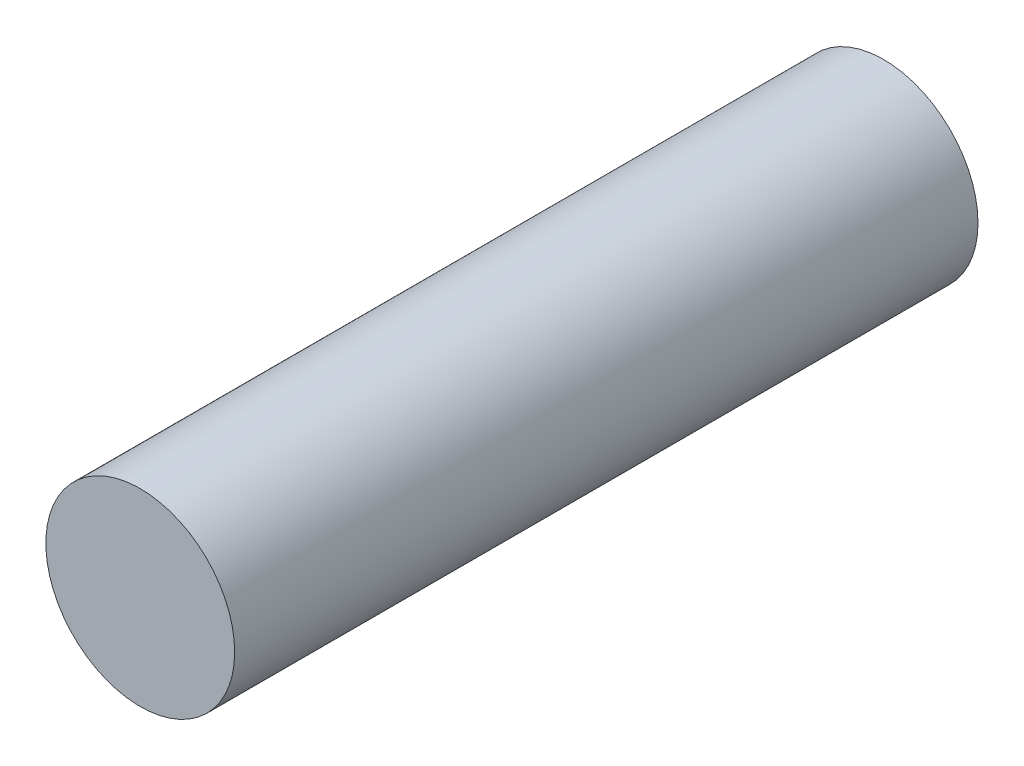
ISO-10303-21;
HEADER;
FILE_DESCRIPTION(('STEP AP214'),'2;1');
FILE_NAME('part.step','',(''),(''),'','','');
FILE_SCHEMA(('AUTOMOTIVE_DESIGN { 1 0 10303 214 1 1 1 1 }'));
ENDSEC;
DATA;
#1=APPLICATION_CONTEXT('core data for automotive mechanical design processes');
#2=APPLICATION_PROTOCOL_DEFINITION('international standard','automotive_design',2000,#1);
#3=PRODUCT_CONTEXT('',#1,'mechanical');
#4=PRODUCT('Part','Part','',(#3));
#5=PRODUCT_RELATED_PRODUCT_CATEGORY('part','',(#4));
#6=PRODUCT_DEFINITION_FORMATION('','',#4);
#7=PRODUCT_DEFINITION_CONTEXT('part definition',#1,'design');
#8=PRODUCT_DEFINITION('design','',#6,#7);
#9=PRODUCT_DEFINITION_SHAPE('','',#8);
#10=(LENGTH_UNIT() NAMED_UNIT(*) SI_UNIT(.MILLI.,.METRE.));
#11=(NAMED_UNIT(*) PLANE_ANGLE_UNIT() SI_UNIT($,.RADIAN.));
#12=(NAMED_UNIT(*) SI_UNIT($,.STERADIAN.) SOLID_ANGLE_UNIT());
#13=UNCERTAINTY_MEASURE_WITH_UNIT(LENGTH_MEASURE(1.E-05),#10,'distance_accuracy_value','');
#14=(GEOMETRIC_REPRESENTATION_CONTEXT(3) GLOBAL_UNCERTAINTY_ASSIGNED_CONTEXT((#13)) GLOBAL_UNIT_ASSIGNED_CONTEXT((#10,
#11,#12)) REPRESENTATION_CONTEXT('',''));
#15=CARTESIAN_POINT('',(0.,0.,0.));
#16=DIRECTION('',(0.,0.,1.));
#17=DIRECTION('',(1.,0.,0.));
#18=AXIS2_PLACEMENT_3D('',#15,#16,#17);
#19=CARTESIAN_POINT('',(0.,0.,1.00000000000006));
#20=DIRECTION('',(0.,0.,1.));
#21=DIRECTION('',(1.,0.,0.));
#22=AXIS2_PLACEMENT_3D('',#19,#20,#21);
#23=PLANE('',#22);
#24=CARTESIAN_POINT('',(0.,0.,1.00000000000006));
#25=DIRECTION('',(0.,0.,1.));
#26=DIRECTION('',(1.,0.,0.));
#27=AXIS2_PLACEMENT_3D('',#24,#25,#26);
#28=CIRCLE('',#27,0.127);
#29=CARTESIAN_POINT('',(0.127,0.,1.00000000000006));
#30=VERTEX_POINT('',#29);
#31=EDGE_CURVE('E18',#30,#30,#28,.F.);
#32=ORIENTED_EDGE('',*,*,#31,.F.);
#33=EDGE_LOOP('',(#32));
#34=FACE_BOUND('',#33,.T.);
#35=ADVANCED_FACE('F15',(#34),#23,.T.);
#36=CARTESIAN_POINT('',(0.,0.,0.));
#37=DIRECTION('',(0.,0.,1.));
#38=DIRECTION('',(1.,0.,0.));
#39=AXIS2_PLACEMENT_3D('',#36,#37,#38);
#40=PLANE('',#39);
#41=CARTESIAN_POINT('',(0.,0.,0.));
#42=DIRECTION('',(0.,0.,1.));
#43=DIRECTION('',(1.,0.,0.));
#44=AXIS2_PLACEMENT_3D('',#41,#42,#43);
#45=CIRCLE('',#44,0.127);
#46=CARTESIAN_POINT('',(0.127,0.,0.));
#47=VERTEX_POINT('',#46);
#48=EDGE_CURVE('E10',#47,#47,#45,.T.);
#49=ORIENTED_EDGE('',*,*,#48,.F.);
#50=EDGE_LOOP('',(#49));
#51=FACE_BOUND('',#50,.T.);
#52=ADVANCED_FACE('F30',(#51),#40,.F.);
#53=CARTESIAN_POINT('',(0.,0.,0.));
#54=DIRECTION('',(0.,0.,1.));
#55=DIRECTION('',(1.,0.,0.));
#56=AXIS2_PLACEMENT_3D('',#53,#54,#55);
#57=CYLINDRICAL_SURFACE('',#56,0.127);
#58=ORIENTED_EDGE('',*,*,#31,.T.);
#59=EDGE_LOOP('',(#58));
#60=FACE_BOUND('',#59,.T.);
#61=ORIENTED_EDGE('',*,*,#48,.T.);
#62=EDGE_LOOP('',(#61));
#63=FACE_BOUND('',#62,.T.);
#64=ADVANCED_FACE('F27',(#60,#63),#57,.T.);
#65=CLOSED_SHELL('',(#35,#52,#64));
#66=MANIFOLD_SOLID_BREP('B1',#65);
#67=ADVANCED_BREP_SHAPE_REPRESENTATION('',(#18,#66),#14);
#68=SHAPE_DEFINITION_REPRESENTATION(#9,#67);
ENDSEC;
END-ISO-10303-21;
